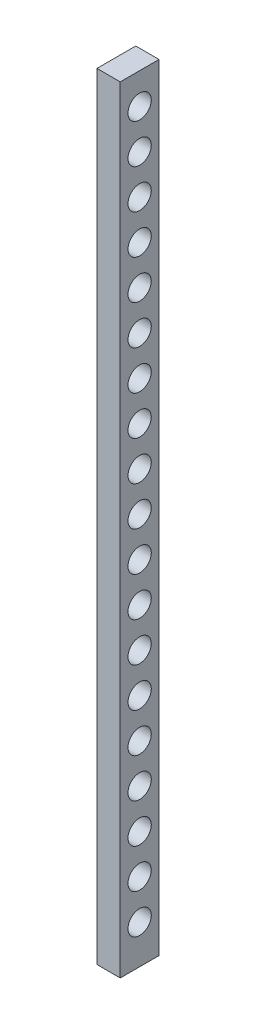
ISO-10303-21;
HEADER;
FILE_DESCRIPTION(('STEP AP214'),'2;1');
FILE_NAME('part.step','',(''),(''),'','','');
FILE_SCHEMA(('AUTOMOTIVE_DESIGN { 1 0 10303 214 1 1 1 1 }'));
ENDSEC;
DATA;
#1=APPLICATION_CONTEXT('core data for automotive mechanical design processes');
#2=APPLICATION_PROTOCOL_DEFINITION('international standard','automotive_design',2000,#1);
#3=PRODUCT_CONTEXT('',#1,'mechanical');
#4=PRODUCT('Part','Part','',(#3));
#5=PRODUCT_RELATED_PRODUCT_CATEGORY('part','',(#4));
#6=PRODUCT_DEFINITION_FORMATION('','',#4);
#7=PRODUCT_DEFINITION_CONTEXT('part definition',#1,'design');
#8=PRODUCT_DEFINITION('design','',#6,#7);
#9=PRODUCT_DEFINITION_SHAPE('','',#8);
#10=(LENGTH_UNIT() NAMED_UNIT(*) SI_UNIT(.MILLI.,.METRE.));
#11=(NAMED_UNIT(*) PLANE_ANGLE_UNIT() SI_UNIT($,.RADIAN.));
#12=(NAMED_UNIT(*) SI_UNIT($,.STERADIAN.) SOLID_ANGLE_UNIT());
#13=UNCERTAINTY_MEASURE_WITH_UNIT(LENGTH_MEASURE(1.E-05),#10,'distance_accuracy_value','');
#14=(GEOMETRIC_REPRESENTATION_CONTEXT(3) GLOBAL_UNCERTAINTY_ASSIGNED_CONTEXT((#13)) GLOBAL_UNIT_ASSIGNED_CONTEXT((#10,
#11,#12)) REPRESENTATION_CONTEXT('',''));
#15=CARTESIAN_POINT('',(0.,0.,0.));
#16=DIRECTION('',(0.,0.,1.));
#17=DIRECTION('',(1.,0.,0.));
#18=AXIS2_PLACEMENT_3D('',#15,#16,#17);
#19=CARTESIAN_POINT('',(6.,0.,-10.));
#20=DIRECTION('',(0.,0.,-1.));
#21=DIRECTION('',(0.,1.,0.));
#22=AXIS2_PLACEMENT_3D('',#19,#20,#21);
#23=PLANE('',#22);
#24=DIRECTION('',(0.,-1.,0.));
#25=VECTOR('',#24,1.);
#26=CARTESIAN_POINT('',(0.,0.,-10.));
#27=LINE('',#26,#25);
#28=CARTESIAN_POINT('',(0.,0.,-10.));
#29=VERTEX_POINT('',#28);
#30=CARTESIAN_POINT('',(0.,-200.,-10.));
#31=VERTEX_POINT('',#30);
#32=EDGE_CURVE('E191',#29,#31,#27,.T.);
#33=ORIENTED_EDGE('',*,*,#32,.F.);
#34=DIRECTION('',(-1.,0.,0.));
#35=VECTOR('',#34,1.);
#36=CARTESIAN_POINT('',(6.,0.,-10.));
#37=LINE('',#36,#35);
#38=CARTESIAN_POINT('',(6.,0.,-10.));
#39=VERTEX_POINT('',#38);
#40=EDGE_CURVE('E11',#39,#29,#37,.T.);
#41=ORIENTED_EDGE('',*,*,#40,.F.);
#42=DIRECTION('',(0.,-1.,0.));
#43=VECTOR('',#42,1.);
#44=CARTESIAN_POINT('',(6.,0.,-10.));
#45=LINE('',#44,#43);
#46=CARTESIAN_POINT('',(6.,-200.,-10.));
#47=VERTEX_POINT('',#46);
#48=EDGE_CURVE('E105',#39,#47,#45,.T.);
#49=ORIENTED_EDGE('',*,*,#48,.T.);
#50=DIRECTION('',(-1.,0.,0.));
#51=VECTOR('',#50,1.);
#52=CARTESIAN_POINT('',(6.,-200.,-10.));
#53=LINE('',#52,#51);
#54=EDGE_CURVE('E82',#47,#31,#53,.T.);
#55=ORIENTED_EDGE('',*,*,#54,.T.);
#56=EDGE_LOOP('',(#33,#41,#49,#55));
#57=FACE_BOUND('',#56,.T.);
#58=ADVANCED_FACE('F41',(#57),#23,.T.);
#59=CARTESIAN_POINT('',(6.,0.,0.));
#60=DIRECTION('',(0.,1.,0.));
#61=DIRECTION('',(0.,0.,1.));
#62=AXIS2_PLACEMENT_3D('',#59,#60,#61);
#63=PLANE('',#62);
#64=DIRECTION('',(0.,0.,-1.));
#65=VECTOR('',#64,1.);
#66=CARTESIAN_POINT('',(0.,0.,0.));
#67=LINE('',#66,#65);
#68=CARTESIAN_POINT('',(0.,0.,0.));
#69=VERTEX_POINT('',#68);
#70=EDGE_CURVE('E94',#69,#29,#67,.T.);
#71=ORIENTED_EDGE('',*,*,#70,.F.);
#72=DIRECTION('',(-1.,0.,0.));
#73=VECTOR('',#72,1.);
#74=CARTESIAN_POINT('',(6.,0.,0.));
#75=LINE('',#74,#73);
#76=CARTESIAN_POINT('',(6.,0.,0.));
#77=VERTEX_POINT('',#76);
#78=EDGE_CURVE('E51',#77,#69,#75,.T.);
#79=ORIENTED_EDGE('',*,*,#78,.F.);
#80=DIRECTION('',(0.,0.,-1.));
#81=VECTOR('',#80,1.);
#82=CARTESIAN_POINT('',(6.,0.,0.));
#83=LINE('',#82,#81);
#84=EDGE_CURVE('E92',#77,#39,#83,.T.);
#85=ORIENTED_EDGE('',*,*,#84,.T.);
#86=ORIENTED_EDGE('',*,*,#40,.T.);
#87=EDGE_LOOP('',(#71,#79,#85,#86));
#88=FACE_BOUND('',#87,.T.);
#89=ADVANCED_FACE('F90',(#88),#63,.T.);
#90=CARTESIAN_POINT('',(6.,0.,0.));
#91=DIRECTION('',(0.,0.,-1.));
#92=DIRECTION('',(0.,1.,0.));
#93=AXIS2_PLACEMENT_3D('',#90,#91,#92);
#94=PLANE('',#93);
#95=DIRECTION('',(0.,-1.,0.));
#96=VECTOR('',#95,1.);
#97=CARTESIAN_POINT('',(0.,0.,0.));
#98=LINE('',#97,#96);
#99=CARTESIAN_POINT('',(0.,-200.,0.));
#100=VERTEX_POINT('',#99);
#101=EDGE_CURVE('E196',#69,#100,#98,.T.);
#102=ORIENTED_EDGE('',*,*,#101,.T.);
#103=DIRECTION('',(-1.,0.,0.));
#104=VECTOR('',#103,1.);
#105=CARTESIAN_POINT('',(6.,-200.,0.));
#106=LINE('',#105,#104);
#107=CARTESIAN_POINT('',(6.,-200.,0.));
#108=VERTEX_POINT('',#107);
#109=EDGE_CURVE('E98',#108,#100,#106,.T.);
#110=ORIENTED_EDGE('',*,*,#109,.F.);
#111=DIRECTION('',(0.,-1.,0.));
#112=VECTOR('',#111,1.);
#113=CARTESIAN_POINT('',(6.,0.,0.));
#114=LINE('',#113,#112);
#115=EDGE_CURVE('E100',#77,#108,#114,.T.);
#116=ORIENTED_EDGE('',*,*,#115,.F.);
#117=ORIENTED_EDGE('',*,*,#78,.T.);
#118=EDGE_LOOP('',(#102,#110,#116,#117));
#119=FACE_BOUND('',#118,.T.);
#120=ADVANCED_FACE('F101',(#119),#94,.F.);
#121=CARTESIAN_POINT('',(6.,-7.99814453350382,-5.));
#122=DIRECTION('',(-1.,0.,0.));
#123=DIRECTION('',(0.,0.,1.));
#124=AXIS2_PLACEMENT_3D('',#121,#122,#123);
#125=CYLINDRICAL_SURFACE('',#124,3.);
#126=CARTESIAN_POINT('',(6.,-7.99814453350382,-5.));
#127=DIRECTION('',(1.,0.,0.));
#128=DIRECTION('',(0.,0.,-1.));
#129=AXIS2_PLACEMENT_3D('',#126,#127,#128);
#130=CIRCLE('',#129,3.);
#131=CARTESIAN_POINT('',(6.,-7.99814453350382,-8.));
#132=VERTEX_POINT('',#131);
#133=EDGE_CURVE('E109',#132,#132,#130,.T.);
#134=ORIENTED_EDGE('',*,*,#133,.T.);
#135=EDGE_LOOP('',(#134));
#136=FACE_BOUND('',#135,.T.);
#137=CARTESIAN_POINT('',(0.,-7.99814453350382,-5.));
#138=DIRECTION('',(1.,0.,0.));
#139=DIRECTION('',(0.,0.,-1.));
#140=AXIS2_PLACEMENT_3D('',#137,#138,#139);
#141=CIRCLE('',#140,3.);
#142=CARTESIAN_POINT('',(0.,-7.99814453350382,-8.));
#143=VERTEX_POINT('',#142);
#144=EDGE_CURVE('E187',#143,#143,#141,.T.);
#145=ORIENTED_EDGE('',*,*,#144,.F.);
#146=EDGE_LOOP('',(#145));
#147=FACE_BOUND('',#146,.T.);
#148=ADVANCED_FACE('F216',(#136,#147),#125,.F.);
#149=CARTESIAN_POINT('',(6.,-18.1091667987184,-5.00000000000014));
#150=DIRECTION('',(-1.,0.,0.));
#151=DIRECTION('',(0.,0.,1.));
#152=AXIS2_PLACEMENT_3D('',#149,#150,#151);
#153=CYLINDRICAL_SURFACE('',#152,3.);
#154=CARTESIAN_POINT('',(6.,-18.1091667987184,-5.00000000000014));
#155=DIRECTION('',(1.,0.,0.));
#156=DIRECTION('',(0.,0.,-1.));
#157=AXIS2_PLACEMENT_3D('',#154,#155,#156);
#158=CIRCLE('',#157,3.);
#159=CARTESIAN_POINT('',(6.,-18.1091667987184,-8.00000000000014));
#160=VERTEX_POINT('',#159);
#161=EDGE_CURVE('E577',#160,#160,#158,.T.);
#162=ORIENTED_EDGE('',*,*,#161,.T.);
#163=EDGE_LOOP('',(#162));
#164=FACE_BOUND('',#163,.T.);
#165=CARTESIAN_POINT('',(0.,-18.1091667987184,-5.00000000000014));
#166=DIRECTION('',(1.,0.,0.));
#167=DIRECTION('',(0.,0.,-1.));
#168=AXIS2_PLACEMENT_3D('',#165,#166,#167);
#169=CIRCLE('',#168,3.);
#170=CARTESIAN_POINT('',(0.,-18.1091667987184,-8.00000000000014));
#171=VERTEX_POINT('',#170);
#172=EDGE_CURVE('E183',#171,#171,#169,.T.);
#173=ORIENTED_EDGE('',*,*,#172,.F.);
#174=EDGE_LOOP('',(#173));
#175=FACE_BOUND('',#174,.T.);
#176=ADVANCED_FACE('F219',(#164,#175),#153,.F.);
#177=CARTESIAN_POINT('',(6.,-28.220189063933,-5.00000000000028));
#178=DIRECTION('',(-1.,0.,0.));
#179=DIRECTION('',(0.,0.,1.));
#180=AXIS2_PLACEMENT_3D('',#177,#178,#179);
#181=CYLINDRICAL_SURFACE('',#180,3.);
#182=CARTESIAN_POINT('',(6.,-28.220189063933,-5.00000000000028));
#183=DIRECTION('',(1.,0.,0.));
#184=DIRECTION('',(0.,0.,-1.));
#185=AXIS2_PLACEMENT_3D('',#182,#183,#184);
#186=CIRCLE('',#185,3.);
#187=CARTESIAN_POINT('',(6.,-28.220189063933,-8.00000000000028));
#188=VERTEX_POINT('',#187);
#189=EDGE_CURVE('E573',#188,#188,#186,.T.);
#190=ORIENTED_EDGE('',*,*,#189,.T.);
#191=EDGE_LOOP('',(#190));
#192=FACE_BOUND('',#191,.T.);
#193=CARTESIAN_POINT('',(0.,-28.220189063933,-5.00000000000028));
#194=DIRECTION('',(1.,0.,0.));
#195=DIRECTION('',(0.,0.,-1.));
#196=AXIS2_PLACEMENT_3D('',#193,#194,#195);
#197=CIRCLE('',#196,3.);
#198=CARTESIAN_POINT('',(0.,-28.220189063933,-8.00000000000028));
#199=VERTEX_POINT('',#198);
#200=EDGE_CURVE('E179',#199,#199,#197,.T.);
#201=ORIENTED_EDGE('',*,*,#200,.F.);
#202=EDGE_LOOP('',(#201));
#203=FACE_BOUND('',#202,.T.);
#204=ADVANCED_FACE('F223',(#192,#203),#181,.F.);
#205=CARTESIAN_POINT('',(6.,-38.3312113291476,-5.00000000000043));
#206=DIRECTION('',(-1.,0.,0.));
#207=DIRECTION('',(0.,0.,1.));
#208=AXIS2_PLACEMENT_3D('',#205,#206,#207);
#209=CYLINDRICAL_SURFACE('',#208,3.);
#210=CARTESIAN_POINT('',(6.,-38.3312113291476,-5.00000000000043));
#211=DIRECTION('',(1.,0.,0.));
#212=DIRECTION('',(0.,0.,-1.));
#213=AXIS2_PLACEMENT_3D('',#210,#211,#212);
#214=CIRCLE('',#213,3.);
#215=CARTESIAN_POINT('',(6.,-38.3312113291476,-8.00000000000043));
#216=VERTEX_POINT('',#215);
#217=EDGE_CURVE('E569',#216,#216,#214,.T.);
#218=ORIENTED_EDGE('',*,*,#217,.T.);
#219=EDGE_LOOP('',(#218));
#220=FACE_BOUND('',#219,.T.);
#221=CARTESIAN_POINT('',(0.,-38.3312113291476,-5.00000000000043));
#222=DIRECTION('',(1.,0.,0.));
#223=DIRECTION('',(0.,0.,-1.));
#224=AXIS2_PLACEMENT_3D('',#221,#222,#223);
#225=CIRCLE('',#224,3.);
#226=CARTESIAN_POINT('',(0.,-38.3312113291476,-8.00000000000043));
#227=VERTEX_POINT('',#226);
#228=EDGE_CURVE('E175',#227,#227,#225,.T.);
#229=ORIENTED_EDGE('',*,*,#228,.F.);
#230=EDGE_LOOP('',(#229));
#231=FACE_BOUND('',#230,.T.);
#232=ADVANCED_FACE('F227',(#220,#231),#209,.F.);
#233=CARTESIAN_POINT('',(6.,-48.4422335943621,-5.00000000000057));
#234=DIRECTION('',(-1.,0.,0.));
#235=DIRECTION('',(0.,0.,1.));
#236=AXIS2_PLACEMENT_3D('',#233,#234,#235);
#237=CYLINDRICAL_SURFACE('',#236,3.);
#238=CARTESIAN_POINT('',(6.,-48.4422335943621,-5.00000000000057));
#239=DIRECTION('',(1.,0.,0.));
#240=DIRECTION('',(0.,0.,-1.));
#241=AXIS2_PLACEMENT_3D('',#238,#239,#240);
#242=CIRCLE('',#241,3.);
#243=CARTESIAN_POINT('',(6.,-48.4422335943621,-8.00000000000057));
#244=VERTEX_POINT('',#243);
#245=EDGE_CURVE('E565',#244,#244,#242,.T.);
#246=ORIENTED_EDGE('',*,*,#245,.T.);
#247=EDGE_LOOP('',(#246));
#248=FACE_BOUND('',#247,.T.);
#249=CARTESIAN_POINT('',(0.,-48.4422335943621,-5.00000000000057));
#250=DIRECTION('',(1.,0.,0.));
#251=DIRECTION('',(0.,0.,-1.));
#252=AXIS2_PLACEMENT_3D('',#249,#250,#251);
#253=CIRCLE('',#252,3.);
#254=CARTESIAN_POINT('',(0.,-48.4422335943621,-8.00000000000057));
#255=VERTEX_POINT('',#254);
#256=EDGE_CURVE('E171',#255,#255,#253,.T.);
#257=ORIENTED_EDGE('',*,*,#256,.F.);
#258=EDGE_LOOP('',(#257));
#259=FACE_BOUND('',#258,.T.);
#260=ADVANCED_FACE('F231',(#248,#259),#237,.F.);
#261=CARTESIAN_POINT('',(6.,-58.5532558595767,-5.00000000000071));
#262=DIRECTION('',(-1.,0.,0.));
#263=DIRECTION('',(0.,0.,1.));
#264=AXIS2_PLACEMENT_3D('',#261,#262,#263);
#265=CYLINDRICAL_SURFACE('',#264,3.);
#266=CARTESIAN_POINT('',(6.,-58.5532558595767,-5.00000000000071));
#267=DIRECTION('',(1.,0.,0.));
#268=DIRECTION('',(0.,0.,-1.));
#269=AXIS2_PLACEMENT_3D('',#266,#267,#268);
#270=CIRCLE('',#269,3.);
#271=CARTESIAN_POINT('',(6.,-58.5532558595767,-8.00000000000071));
#272=VERTEX_POINT('',#271);
#273=EDGE_CURVE('E561',#272,#272,#270,.T.);
#274=ORIENTED_EDGE('',*,*,#273,.T.);
#275=EDGE_LOOP('',(#274));
#276=FACE_BOUND('',#275,.T.);
#277=CARTESIAN_POINT('',(0.,-58.5532558595767,-5.00000000000071));
#278=DIRECTION('',(1.,0.,0.));
#279=DIRECTION('',(0.,0.,-1.));
#280=AXIS2_PLACEMENT_3D('',#277,#278,#279);
#281=CIRCLE('',#280,3.);
#282=CARTESIAN_POINT('',(0.,-58.5532558595767,-8.00000000000071));
#283=VERTEX_POINT('',#282);
#284=EDGE_CURVE('E167',#283,#283,#281,.T.);
#285=ORIENTED_EDGE('',*,*,#284,.F.);
#286=EDGE_LOOP('',(#285));
#287=FACE_BOUND('',#286,.T.);
#288=ADVANCED_FACE('F235',(#276,#287),#265,.F.);
#289=CARTESIAN_POINT('',(6.,-68.6642781247913,-5.00000000000085));
#290=DIRECTION('',(-1.,0.,0.));
#291=DIRECTION('',(0.,0.,1.));
#292=AXIS2_PLACEMENT_3D('',#289,#290,#291);
#293=CYLINDRICAL_SURFACE('',#292,3.);
#294=CARTESIAN_POINT('',(6.,-68.6642781247913,-5.00000000000085));
#295=DIRECTION('',(1.,0.,0.));
#296=DIRECTION('',(0.,0.,-1.));
#297=AXIS2_PLACEMENT_3D('',#294,#295,#296);
#298=CIRCLE('',#297,3.);
#299=CARTESIAN_POINT('',(6.,-68.6642781247913,-8.00000000000085));
#300=VERTEX_POINT('',#299);
#301=EDGE_CURVE('E557',#300,#300,#298,.T.);
#302=ORIENTED_EDGE('',*,*,#301,.T.);
#303=EDGE_LOOP('',(#302));
#304=FACE_BOUND('',#303,.T.);
#305=CARTESIAN_POINT('',(0.,-68.6642781247913,-5.00000000000085));
#306=DIRECTION('',(1.,0.,0.));
#307=DIRECTION('',(0.,0.,-1.));
#308=AXIS2_PLACEMENT_3D('',#305,#306,#307);
#309=CIRCLE('',#308,3.);
#310=CARTESIAN_POINT('',(0.,-68.6642781247913,-8.00000000000085));
#311=VERTEX_POINT('',#310);
#312=EDGE_CURVE('E163',#311,#311,#309,.T.);
#313=ORIENTED_EDGE('',*,*,#312,.F.);
#314=EDGE_LOOP('',(#313));
#315=FACE_BOUND('',#314,.T.);
#316=ADVANCED_FACE('F239',(#304,#315),#293,.F.);
#317=CARTESIAN_POINT('',(6.,-78.7753003900059,-5.00000000000099));
#318=DIRECTION('',(-1.,0.,0.));
#319=DIRECTION('',(0.,0.,1.));
#320=AXIS2_PLACEMENT_3D('',#317,#318,#319);
#321=CYLINDRICAL_SURFACE('',#320,3.);
#322=CARTESIAN_POINT('',(6.,-78.7753003900059,-5.00000000000099));
#323=DIRECTION('',(1.,0.,0.));
#324=DIRECTION('',(0.,0.,-1.));
#325=AXIS2_PLACEMENT_3D('',#322,#323,#324);
#326=CIRCLE('',#325,3.);
#327=CARTESIAN_POINT('',(6.,-78.7753003900059,-8.00000000000099));
#328=VERTEX_POINT('',#327);
#329=EDGE_CURVE('E553',#328,#328,#326,.T.);
#330=ORIENTED_EDGE('',*,*,#329,.T.);
#331=EDGE_LOOP('',(#330));
#332=FACE_BOUND('',#331,.T.);
#333=CARTESIAN_POINT('',(0.,-78.7753003900059,-5.00000000000099));
#334=DIRECTION('',(1.,0.,0.));
#335=DIRECTION('',(0.,0.,-1.));
#336=AXIS2_PLACEMENT_3D('',#333,#334,#335);
#337=CIRCLE('',#336,3.);
#338=CARTESIAN_POINT('',(0.,-78.7753003900059,-8.00000000000099));
#339=VERTEX_POINT('',#338);
#340=EDGE_CURVE('E159',#339,#339,#337,.T.);
#341=ORIENTED_EDGE('',*,*,#340,.F.);
#342=EDGE_LOOP('',(#341));
#343=FACE_BOUND('',#342,.T.);
#344=ADVANCED_FACE('F243',(#332,#343),#321,.F.);
#345=CARTESIAN_POINT('',(6.,-88.8863226552204,-5.00000000000114));
#346=DIRECTION('',(-1.,0.,0.));
#347=DIRECTION('',(0.,0.,1.));
#348=AXIS2_PLACEMENT_3D('',#345,#346,#347);
#349=CYLINDRICAL_SURFACE('',#348,3.);
#350=CARTESIAN_POINT('',(6.,-88.8863226552204,-5.00000000000114));
#351=DIRECTION('',(1.,0.,0.));
#352=DIRECTION('',(0.,0.,-1.));
#353=AXIS2_PLACEMENT_3D('',#350,#351,#352);
#354=CIRCLE('',#353,3.);
#355=CARTESIAN_POINT('',(6.,-88.8863226552204,-8.00000000000114));
#356=VERTEX_POINT('',#355);
#357=EDGE_CURVE('E549',#356,#356,#354,.T.);
#358=ORIENTED_EDGE('',*,*,#357,.T.);
#359=EDGE_LOOP('',(#358));
#360=FACE_BOUND('',#359,.T.);
#361=CARTESIAN_POINT('',(0.,-88.8863226552204,-5.00000000000114));
#362=DIRECTION('',(1.,0.,0.));
#363=DIRECTION('',(0.,0.,-1.));
#364=AXIS2_PLACEMENT_3D('',#361,#362,#363);
#365=CIRCLE('',#364,3.);
#366=CARTESIAN_POINT('',(0.,-88.8863226552204,-8.00000000000114));
#367=VERTEX_POINT('',#366);
#368=EDGE_CURVE('E155',#367,#367,#365,.T.);
#369=ORIENTED_EDGE('',*,*,#368,.F.);
#370=EDGE_LOOP('',(#369));
#371=FACE_BOUND('',#370,.T.);
#372=ADVANCED_FACE('F247',(#360,#371),#349,.F.);
#373=CARTESIAN_POINT('',(6.,-98.997344920435,-5.00000000000128));
#374=DIRECTION('',(-1.,0.,0.));
#375=DIRECTION('',(0.,0.,1.));
#376=AXIS2_PLACEMENT_3D('',#373,#374,#375);
#377=CYLINDRICAL_SURFACE('',#376,3.);
#378=CARTESIAN_POINT('',(6.,-98.997344920435,-5.00000000000128));
#379=DIRECTION('',(1.,0.,0.));
#380=DIRECTION('',(0.,0.,-1.));
#381=AXIS2_PLACEMENT_3D('',#378,#379,#380);
#382=CIRCLE('',#381,3.);
#383=CARTESIAN_POINT('',(6.,-98.997344920435,-8.00000000000128));
#384=VERTEX_POINT('',#383);
#385=EDGE_CURVE('E545',#384,#384,#382,.T.);
#386=ORIENTED_EDGE('',*,*,#385,.T.);
#387=EDGE_LOOP('',(#386));
#388=FACE_BOUND('',#387,.T.);
#389=CARTESIAN_POINT('',(0.,-98.997344920435,-5.00000000000128));
#390=DIRECTION('',(1.,0.,0.));
#391=DIRECTION('',(0.,0.,-1.));
#392=AXIS2_PLACEMENT_3D('',#389,#390,#391);
#393=CIRCLE('',#392,3.);
#394=CARTESIAN_POINT('',(0.,-98.997344920435,-8.00000000000128));
#395=VERTEX_POINT('',#394);
#396=EDGE_CURVE('E151',#395,#395,#393,.T.);
#397=ORIENTED_EDGE('',*,*,#396,.F.);
#398=EDGE_LOOP('',(#397));
#399=FACE_BOUND('',#398,.T.);
#400=ADVANCED_FACE('F251',(#388,#399),#377,.F.);
#401=CARTESIAN_POINT('',(6.,-109.10836718565,-5.00000000000142));
#402=DIRECTION('',(-1.,0.,0.));
#403=DIRECTION('',(0.,0.,1.));
#404=AXIS2_PLACEMENT_3D('',#401,#402,#403);
#405=CYLINDRICAL_SURFACE('',#404,3.);
#406=CARTESIAN_POINT('',(6.,-109.10836718565,-5.00000000000142));
#407=DIRECTION('',(1.,0.,0.));
#408=DIRECTION('',(0.,0.,-1.));
#409=AXIS2_PLACEMENT_3D('',#406,#407,#408);
#410=CIRCLE('',#409,3.);
#411=CARTESIAN_POINT('',(6.,-109.10836718565,-8.00000000000142));
#412=VERTEX_POINT('',#411);
#413=EDGE_CURVE('E541',#412,#412,#410,.T.);
#414=ORIENTED_EDGE('',*,*,#413,.T.);
#415=EDGE_LOOP('',(#414));
#416=FACE_BOUND('',#415,.T.);
#417=CARTESIAN_POINT('',(0.,-109.10836718565,-5.00000000000142));
#418=DIRECTION('',(1.,0.,0.));
#419=DIRECTION('',(0.,0.,-1.));
#420=AXIS2_PLACEMENT_3D('',#417,#418,#419);
#421=CIRCLE('',#420,3.);
#422=CARTESIAN_POINT('',(0.,-109.10836718565,-8.00000000000142));
#423=VERTEX_POINT('',#422);
#424=EDGE_CURVE('E147',#423,#423,#421,.T.);
#425=ORIENTED_EDGE('',*,*,#424,.F.);
#426=EDGE_LOOP('',(#425));
#427=FACE_BOUND('',#426,.T.);
#428=ADVANCED_FACE('F255',(#416,#427),#405,.F.);
#429=CARTESIAN_POINT('',(6.,-119.219389450864,-5.00000000000156));
#430=DIRECTION('',(-1.,0.,0.));
#431=DIRECTION('',(0.,0.,1.));
#432=AXIS2_PLACEMENT_3D('',#429,#430,#431);
#433=CYLINDRICAL_SURFACE('',#432,3.);
#434=CARTESIAN_POINT('',(6.,-119.219389450864,-5.00000000000156));
#435=DIRECTION('',(1.,0.,0.));
#436=DIRECTION('',(0.,0.,-1.));
#437=AXIS2_PLACEMENT_3D('',#434,#435,#436);
#438=CIRCLE('',#437,3.);
#439=CARTESIAN_POINT('',(6.,-119.219389450864,-8.00000000000156));
#440=VERTEX_POINT('',#439);
#441=EDGE_CURVE('E537',#440,#440,#438,.T.);
#442=ORIENTED_EDGE('',*,*,#441,.T.);
#443=EDGE_LOOP('',(#442));
#444=FACE_BOUND('',#443,.T.);
#445=CARTESIAN_POINT('',(0.,-119.219389450864,-5.00000000000156));
#446=DIRECTION('',(1.,0.,0.));
#447=DIRECTION('',(0.,0.,-1.));
#448=AXIS2_PLACEMENT_3D('',#445,#446,#447);
#449=CIRCLE('',#448,3.);
#450=CARTESIAN_POINT('',(0.,-119.219389450864,-8.00000000000156));
#451=VERTEX_POINT('',#450);
#452=EDGE_CURVE('E143',#451,#451,#449,.T.);
#453=ORIENTED_EDGE('',*,*,#452,.F.);
#454=EDGE_LOOP('',(#453));
#455=FACE_BOUND('',#454,.T.);
#456=ADVANCED_FACE('F259',(#444,#455),#433,.F.);
#457=CARTESIAN_POINT('',(6.,-129.330411716079,-5.0000000000017));
#458=DIRECTION('',(-1.,0.,0.));
#459=DIRECTION('',(0.,0.,1.));
#460=AXIS2_PLACEMENT_3D('',#457,#458,#459);
#461=CYLINDRICAL_SURFACE('',#460,2.99999999999999);
#462=CARTESIAN_POINT('',(6.,-129.330411716079,-5.0000000000017));
#463=DIRECTION('',(1.,0.,0.));
#464=DIRECTION('',(0.,0.,-1.));
#465=AXIS2_PLACEMENT_3D('',#462,#463,#464);
#466=CIRCLE('',#465,2.99999999999999);
#467=CARTESIAN_POINT('',(6.,-129.330411716079,-8.00000000000169));
#468=VERTEX_POINT('',#467);
#469=EDGE_CURVE('E533',#468,#468,#466,.T.);
#470=ORIENTED_EDGE('',*,*,#469,.T.);
#471=EDGE_LOOP('',(#470));
#472=FACE_BOUND('',#471,.T.);
#473=CARTESIAN_POINT('',(0.,-129.330411716079,-5.0000000000017));
#474=DIRECTION('',(1.,0.,0.));
#475=DIRECTION('',(0.,0.,-1.));
#476=AXIS2_PLACEMENT_3D('',#473,#474,#475);
#477=CIRCLE('',#476,2.99999999999999);
#478=CARTESIAN_POINT('',(0.,-129.330411716079,-8.00000000000169));
#479=VERTEX_POINT('',#478);
#480=EDGE_CURVE('E139',#479,#479,#477,.T.);
#481=ORIENTED_EDGE('',*,*,#480,.F.);
#482=EDGE_LOOP('',(#481));
#483=FACE_BOUND('',#482,.T.);
#484=ADVANCED_FACE('F263',(#472,#483),#461,.F.);
#485=CARTESIAN_POINT('',(6.,-139.441433981293,-5.00000000000184));
#486=DIRECTION('',(-1.,0.,0.));
#487=DIRECTION('',(0.,0.,1.));
#488=AXIS2_PLACEMENT_3D('',#485,#486,#487);
#489=CYLINDRICAL_SURFACE('',#488,3.);
#490=CARTESIAN_POINT('',(6.,-139.441433981293,-5.00000000000184));
#491=DIRECTION('',(1.,0.,0.));
#492=DIRECTION('',(0.,0.,-1.));
#493=AXIS2_PLACEMENT_3D('',#490,#491,#492);
#494=CIRCLE('',#493,3.);
#495=CARTESIAN_POINT('',(6.,-139.441433981293,-8.00000000000185));
#496=VERTEX_POINT('',#495);
#497=EDGE_CURVE('E529',#496,#496,#494,.T.);
#498=ORIENTED_EDGE('',*,*,#497,.T.);
#499=EDGE_LOOP('',(#498));
#500=FACE_BOUND('',#499,.T.);
#501=CARTESIAN_POINT('',(0.,-139.441433981293,-5.00000000000184));
#502=DIRECTION('',(1.,0.,0.));
#503=DIRECTION('',(0.,0.,-1.));
#504=AXIS2_PLACEMENT_3D('',#501,#502,#503);
#505=CIRCLE('',#504,3.);
#506=CARTESIAN_POINT('',(0.,-139.441433981293,-8.00000000000185));
#507=VERTEX_POINT('',#506);
#508=EDGE_CURVE('E135',#507,#507,#505,.T.);
#509=ORIENTED_EDGE('',*,*,#508,.F.);
#510=EDGE_LOOP('',(#509));
#511=FACE_BOUND('',#510,.T.);
#512=ADVANCED_FACE('F267',(#500,#511),#489,.F.);
#513=CARTESIAN_POINT('',(6.,-149.552456246508,-5.00000000000199));
#514=DIRECTION('',(-1.,0.,0.));
#515=DIRECTION('',(0.,0.,1.));
#516=AXIS2_PLACEMENT_3D('',#513,#514,#515);
#517=CYLINDRICAL_SURFACE('',#516,3.);
#518=CARTESIAN_POINT('',(6.,-149.552456246508,-5.00000000000199));
#519=DIRECTION('',(1.,0.,0.));
#520=DIRECTION('',(0.,0.,-1.));
#521=AXIS2_PLACEMENT_3D('',#518,#519,#520);
#522=CIRCLE('',#521,3.);
#523=CARTESIAN_POINT('',(6.,-149.552456246508,-8.00000000000199));
#524=VERTEX_POINT('',#523);
#525=EDGE_CURVE('E525',#524,#524,#522,.T.);
#526=ORIENTED_EDGE('',*,*,#525,.T.);
#527=EDGE_LOOP('',(#526));
#528=FACE_BOUND('',#527,.T.);
#529=CARTESIAN_POINT('',(0.,-149.552456246508,-5.00000000000199));
#530=DIRECTION('',(1.,0.,0.));
#531=DIRECTION('',(0.,0.,-1.));
#532=AXIS2_PLACEMENT_3D('',#529,#530,#531);
#533=CIRCLE('',#532,3.);
#534=CARTESIAN_POINT('',(0.,-149.552456246508,-8.00000000000199));
#535=VERTEX_POINT('',#534);
#536=EDGE_CURVE('E131',#535,#535,#533,.T.);
#537=ORIENTED_EDGE('',*,*,#536,.F.);
#538=EDGE_LOOP('',(#537));
#539=FACE_BOUND('',#538,.T.);
#540=ADVANCED_FACE('F271',(#528,#539),#517,.F.);
#541=CARTESIAN_POINT('',(6.,-159.663478511722,-5.00000000000213));
#542=DIRECTION('',(-1.,0.,0.));
#543=DIRECTION('',(0.,0.,1.));
#544=AXIS2_PLACEMENT_3D('',#541,#542,#543);
#545=CYLINDRICAL_SURFACE('',#544,2.99999999999999);
#546=CARTESIAN_POINT('',(6.,-159.663478511722,-5.00000000000213));
#547=DIRECTION('',(1.,0.,0.));
#548=DIRECTION('',(0.,0.,-1.));
#549=AXIS2_PLACEMENT_3D('',#546,#547,#548);
#550=CIRCLE('',#549,2.99999999999999);
#551=CARTESIAN_POINT('',(6.,-159.663478511722,-8.00000000000212));
#552=VERTEX_POINT('',#551);
#553=EDGE_CURVE('E521',#552,#552,#550,.T.);
#554=ORIENTED_EDGE('',*,*,#553,.T.);
#555=EDGE_LOOP('',(#554));
#556=FACE_BOUND('',#555,.T.);
#557=CARTESIAN_POINT('',(0.,-159.663478511722,-5.00000000000213));
#558=DIRECTION('',(1.,0.,0.));
#559=DIRECTION('',(0.,0.,-1.));
#560=AXIS2_PLACEMENT_3D('',#557,#558,#559);
#561=CIRCLE('',#560,2.99999999999999);
#562=CARTESIAN_POINT('',(0.,-159.663478511722,-8.00000000000212));
#563=VERTEX_POINT('',#562);
#564=EDGE_CURVE('E127',#563,#563,#561,.T.);
#565=ORIENTED_EDGE('',*,*,#564,.F.);
#566=EDGE_LOOP('',(#565));
#567=FACE_BOUND('',#566,.T.);
#568=ADVANCED_FACE('F275',(#556,#567),#545,.F.);
#569=CARTESIAN_POINT('',(6.,-169.774500776937,-5.00000000000227));
#570=DIRECTION('',(-1.,0.,0.));
#571=DIRECTION('',(0.,0.,1.));
#572=AXIS2_PLACEMENT_3D('',#569,#570,#571);
#573=CYLINDRICAL_SURFACE('',#572,3.);
#574=CARTESIAN_POINT('',(6.,-169.774500776937,-5.00000000000227));
#575=DIRECTION('',(1.,0.,0.));
#576=DIRECTION('',(0.,0.,-1.));
#577=AXIS2_PLACEMENT_3D('',#574,#575,#576);
#578=CIRCLE('',#577,3.);
#579=CARTESIAN_POINT('',(6.,-169.774500776937,-8.00000000000227));
#580=VERTEX_POINT('',#579);
#581=EDGE_CURVE('E517',#580,#580,#578,.T.);
#582=ORIENTED_EDGE('',*,*,#581,.T.);
#583=EDGE_LOOP('',(#582));
#584=FACE_BOUND('',#583,.T.);
#585=CARTESIAN_POINT('',(0.,-169.774500776937,-5.00000000000227));
#586=DIRECTION('',(1.,0.,0.));
#587=DIRECTION('',(0.,0.,-1.));
#588=AXIS2_PLACEMENT_3D('',#585,#586,#587);
#589=CIRCLE('',#588,3.);
#590=CARTESIAN_POINT('',(0.,-169.774500776937,-8.00000000000227));
#591=VERTEX_POINT('',#590);
#592=EDGE_CURVE('E123',#591,#591,#589,.T.);
#593=ORIENTED_EDGE('',*,*,#592,.F.);
#594=EDGE_LOOP('',(#593));
#595=FACE_BOUND('',#594,.T.);
#596=ADVANCED_FACE('F279',(#584,#595),#573,.F.);
#597=CARTESIAN_POINT('',(6.,-179.885523042152,-5.00000000000241));
#598=DIRECTION('',(-1.,0.,0.));
#599=DIRECTION('',(0.,0.,1.));
#600=AXIS2_PLACEMENT_3D('',#597,#598,#599);
#601=CYLINDRICAL_SURFACE('',#600,2.99999999999999);
#602=CARTESIAN_POINT('',(6.,-179.885523042152,-5.00000000000241));
#603=DIRECTION('',(1.,0.,0.));
#604=DIRECTION('',(0.,0.,-1.));
#605=AXIS2_PLACEMENT_3D('',#602,#603,#604);
#606=CIRCLE('',#605,2.99999999999999);
#607=CARTESIAN_POINT('',(6.,-179.885523042152,-8.00000000000241));
#608=VERTEX_POINT('',#607);
#609=EDGE_CURVE('E293',#608,#608,#606,.T.);
#610=ORIENTED_EDGE('',*,*,#609,.T.);
#611=EDGE_LOOP('',(#610));
#612=FACE_BOUND('',#611,.T.);
#613=CARTESIAN_POINT('',(0.,-179.885523042152,-5.00000000000241));
#614=DIRECTION('',(1.,0.,0.));
#615=DIRECTION('',(0.,0.,-1.));
#616=AXIS2_PLACEMENT_3D('',#613,#614,#615);
#617=CIRCLE('',#616,2.99999999999999);
#618=CARTESIAN_POINT('',(0.,-179.885523042152,-8.00000000000241));
#619=VERTEX_POINT('',#618);
#620=EDGE_CURVE('E119',#619,#619,#617,.T.);
#621=ORIENTED_EDGE('',*,*,#620,.F.);
#622=EDGE_LOOP('',(#621));
#623=FACE_BOUND('',#622,.T.);
#624=ADVANCED_FACE('F282',(#612,#623),#601,.F.);
#625=CARTESIAN_POINT('',(6.,-189.996545307366,-5.00000000000255));
#626=DIRECTION('',(-1.,0.,0.));
#627=DIRECTION('',(0.,0.,1.));
#628=AXIS2_PLACEMENT_3D('',#625,#626,#627);
#629=CYLINDRICAL_SURFACE('',#628,3.);
#630=CARTESIAN_POINT('',(6.,-189.996545307366,-5.00000000000255));
#631=DIRECTION('',(1.,0.,0.));
#632=DIRECTION('',(0.,0.,-1.));
#633=AXIS2_PLACEMENT_3D('',#630,#631,#632);
#634=CIRCLE('',#633,3.);
#635=CARTESIAN_POINT('',(6.,-189.996545307366,-8.00000000000255));
#636=VERTEX_POINT('',#635);
#637=EDGE_CURVE('E201',#636,#636,#634,.T.);
#638=ORIENTED_EDGE('',*,*,#637,.T.);
#639=EDGE_LOOP('',(#638));
#640=FACE_BOUND('',#639,.T.);
#641=CARTESIAN_POINT('',(0.,-189.996545307366,-5.00000000000255));
#642=DIRECTION('',(1.,0.,0.));
#643=DIRECTION('',(0.,0.,-1.));
#644=AXIS2_PLACEMENT_3D('',#641,#642,#643);
#645=CIRCLE('',#644,3.);
#646=CARTESIAN_POINT('',(0.,-189.996545307366,-8.00000000000255));
#647=VERTEX_POINT('',#646);
#648=EDGE_CURVE('E115',#647,#647,#645,.T.);
#649=ORIENTED_EDGE('',*,*,#648,.F.);
#650=EDGE_LOOP('',(#649));
#651=FACE_BOUND('',#650,.T.);
#652=ADVANCED_FACE('F43',(#640,#651),#629,.F.);
#653=CARTESIAN_POINT('',(6.,-200.,0.));
#654=DIRECTION('',(0.,1.,0.));
#655=DIRECTION('',(0.,0.,1.));
#656=AXIS2_PLACEMENT_3D('',#653,#654,#655);
#657=PLANE('',#656);
#658=DIRECTION('',(0.,0.,-1.));
#659=VECTOR('',#658,1.);
#660=CARTESIAN_POINT('',(0.,-200.,0.));
#661=LINE('',#660,#659);
#662=EDGE_CURVE('E75',#100,#31,#661,.T.);
#663=ORIENTED_EDGE('',*,*,#662,.T.);
#664=ORIENTED_EDGE('',*,*,#54,.F.);
#665=DIRECTION('',(0.,0.,-1.));
#666=VECTOR('',#665,1.);
#667=CARTESIAN_POINT('',(6.,-200.,0.));
#668=LINE('',#667,#666);
#669=EDGE_CURVE('E59',#108,#47,#668,.T.);
#670=ORIENTED_EDGE('',*,*,#669,.F.);
#671=ORIENTED_EDGE('',*,*,#109,.T.);
#672=EDGE_LOOP('',(#663,#664,#670,#671));
#673=FACE_BOUND('',#672,.T.);
#674=ADVANCED_FACE('F206',(#673),#657,.F.);
#675=CARTESIAN_POINT('',(6.,0.,0.));
#676=DIRECTION('',(1.,0.,0.));
#677=DIRECTION('',(0.,0.,-1.));
#678=AXIS2_PLACEMENT_3D('',#675,#676,#677);
#679=PLANE('',#678);
#680=ORIENTED_EDGE('',*,*,#637,.F.);
#681=EDGE_LOOP('',(#680));
#682=FACE_BOUND('',#681,.T.);
#683=ORIENTED_EDGE('',*,*,#609,.F.);
#684=EDGE_LOOP('',(#683));
#685=FACE_BOUND('',#684,.T.);
#686=ORIENTED_EDGE('',*,*,#581,.F.);
#687=EDGE_LOOP('',(#686));
#688=FACE_BOUND('',#687,.T.);
#689=ORIENTED_EDGE('',*,*,#553,.F.);
#690=EDGE_LOOP('',(#689));
#691=FACE_BOUND('',#690,.T.);
#692=ORIENTED_EDGE('',*,*,#525,.F.);
#693=EDGE_LOOP('',(#692));
#694=FACE_BOUND('',#693,.T.);
#695=ORIENTED_EDGE('',*,*,#497,.F.);
#696=EDGE_LOOP('',(#695));
#697=FACE_BOUND('',#696,.T.);
#698=ORIENTED_EDGE('',*,*,#469,.F.);
#699=EDGE_LOOP('',(#698));
#700=FACE_BOUND('',#699,.T.);
#701=ORIENTED_EDGE('',*,*,#441,.F.);
#702=EDGE_LOOP('',(#701));
#703=FACE_BOUND('',#702,.T.);
#704=ORIENTED_EDGE('',*,*,#413,.F.);
#705=EDGE_LOOP('',(#704));
#706=FACE_BOUND('',#705,.T.);
#707=ORIENTED_EDGE('',*,*,#385,.F.);
#708=EDGE_LOOP('',(#707));
#709=FACE_BOUND('',#708,.T.);
#710=ORIENTED_EDGE('',*,*,#357,.F.);
#711=EDGE_LOOP('',(#710));
#712=FACE_BOUND('',#711,.T.);
#713=ORIENTED_EDGE('',*,*,#329,.F.);
#714=EDGE_LOOP('',(#713));
#715=FACE_BOUND('',#714,.T.);
#716=ORIENTED_EDGE('',*,*,#301,.F.);
#717=EDGE_LOOP('',(#716));
#718=FACE_BOUND('',#717,.T.);
#719=ORIENTED_EDGE('',*,*,#273,.F.);
#720=EDGE_LOOP('',(#719));
#721=FACE_BOUND('',#720,.T.);
#722=ORIENTED_EDGE('',*,*,#245,.F.);
#723=EDGE_LOOP('',(#722));
#724=FACE_BOUND('',#723,.T.);
#725=ORIENTED_EDGE('',*,*,#217,.F.);
#726=EDGE_LOOP('',(#725));
#727=FACE_BOUND('',#726,.T.);
#728=ORIENTED_EDGE('',*,*,#189,.F.);
#729=EDGE_LOOP('',(#728));
#730=FACE_BOUND('',#729,.T.);
#731=ORIENTED_EDGE('',*,*,#161,.F.);
#732=EDGE_LOOP('',(#731));
#733=FACE_BOUND('',#732,.T.);
#734=ORIENTED_EDGE('',*,*,#133,.F.);
#735=EDGE_LOOP('',(#734));
#736=FACE_BOUND('',#735,.T.);
#737=ORIENTED_EDGE('',*,*,#48,.F.);
#738=ORIENTED_EDGE('',*,*,#84,.F.);
#739=ORIENTED_EDGE('',*,*,#115,.T.);
#740=ORIENTED_EDGE('',*,*,#669,.T.);
#741=EDGE_LOOP('',(#737,#738,#739,#740));
#742=FACE_BOUND('',#741,.T.);
#743=ADVANCED_FACE('F104',(#682,#685,#688,#691,#694,#697,#700,#703,#706,#709,#712,#715,#718,
#721,#724,#727,#730,#733,#736,#742),#679,.T.);
#744=CARTESIAN_POINT('',(0.,0.,0.));
#745=DIRECTION('',(1.,0.,0.));
#746=DIRECTION('',(0.,0.,-1.));
#747=AXIS2_PLACEMENT_3D('',#744,#745,#746);
#748=PLANE('',#747);
#749=ORIENTED_EDGE('',*,*,#648,.T.);
#750=EDGE_LOOP('',(#749));
#751=FACE_BOUND('',#750,.T.);
#752=ORIENTED_EDGE('',*,*,#620,.T.);
#753=EDGE_LOOP('',(#752));
#754=FACE_BOUND('',#753,.T.);
#755=ORIENTED_EDGE('',*,*,#592,.T.);
#756=EDGE_LOOP('',(#755));
#757=FACE_BOUND('',#756,.T.);
#758=ORIENTED_EDGE('',*,*,#564,.T.);
#759=EDGE_LOOP('',(#758));
#760=FACE_BOUND('',#759,.T.);
#761=ORIENTED_EDGE('',*,*,#536,.T.);
#762=EDGE_LOOP('',(#761));
#763=FACE_BOUND('',#762,.T.);
#764=ORIENTED_EDGE('',*,*,#508,.T.);
#765=EDGE_LOOP('',(#764));
#766=FACE_BOUND('',#765,.T.);
#767=ORIENTED_EDGE('',*,*,#480,.T.);
#768=EDGE_LOOP('',(#767));
#769=FACE_BOUND('',#768,.T.);
#770=ORIENTED_EDGE('',*,*,#452,.T.);
#771=EDGE_LOOP('',(#770));
#772=FACE_BOUND('',#771,.T.);
#773=ORIENTED_EDGE('',*,*,#424,.T.);
#774=EDGE_LOOP('',(#773));
#775=FACE_BOUND('',#774,.T.);
#776=ORIENTED_EDGE('',*,*,#396,.T.);
#777=EDGE_LOOP('',(#776));
#778=FACE_BOUND('',#777,.T.);
#779=ORIENTED_EDGE('',*,*,#368,.T.);
#780=EDGE_LOOP('',(#779));
#781=FACE_BOUND('',#780,.T.);
#782=ORIENTED_EDGE('',*,*,#340,.T.);
#783=EDGE_LOOP('',(#782));
#784=FACE_BOUND('',#783,.T.);
#785=ORIENTED_EDGE('',*,*,#312,.T.);
#786=EDGE_LOOP('',(#785));
#787=FACE_BOUND('',#786,.T.);
#788=ORIENTED_EDGE('',*,*,#284,.T.);
#789=EDGE_LOOP('',(#788));
#790=FACE_BOUND('',#789,.T.);
#791=ORIENTED_EDGE('',*,*,#256,.T.);
#792=EDGE_LOOP('',(#791));
#793=FACE_BOUND('',#792,.T.);
#794=ORIENTED_EDGE('',*,*,#228,.T.);
#795=EDGE_LOOP('',(#794));
#796=FACE_BOUND('',#795,.T.);
#797=ORIENTED_EDGE('',*,*,#200,.T.);
#798=EDGE_LOOP('',(#797));
#799=FACE_BOUND('',#798,.T.);
#800=ORIENTED_EDGE('',*,*,#172,.T.);
#801=EDGE_LOOP('',(#800));
#802=FACE_BOUND('',#801,.T.);
#803=ORIENTED_EDGE('',*,*,#144,.T.);
#804=EDGE_LOOP('',(#803));
#805=FACE_BOUND('',#804,.T.);
#806=ORIENTED_EDGE('',*,*,#32,.T.);
#807=ORIENTED_EDGE('',*,*,#662,.F.);
#808=ORIENTED_EDGE('',*,*,#101,.F.);
#809=ORIENTED_EDGE('',*,*,#70,.T.);
#810=EDGE_LOOP('',(#806,#807,#808,#809));
#811=FACE_BOUND('',#810,.T.);
#812=ADVANCED_FACE('F207',(#751,#754,#757,#760,#763,#766,#769,#772,#775,#778,#781,#784,#787,
#790,#793,#796,#799,#802,#805,#811),#748,.F.);
#813=CLOSED_SHELL('',(#58,#89,#120,#148,#176,#204,#232,#260,#288,#316,#344,#372,#400,#428,#456,
#484,#512,#540,#568,#596,#624,#652,#674,#743,#812));
#814=MANIFOLD_SOLID_BREP('B2',#813);
#815=ADVANCED_BREP_SHAPE_REPRESENTATION('',(#18,#814),#14);
#816=SHAPE_DEFINITION_REPRESENTATION(#9,#815);
ENDSEC;
END-ISO-10303-21;
